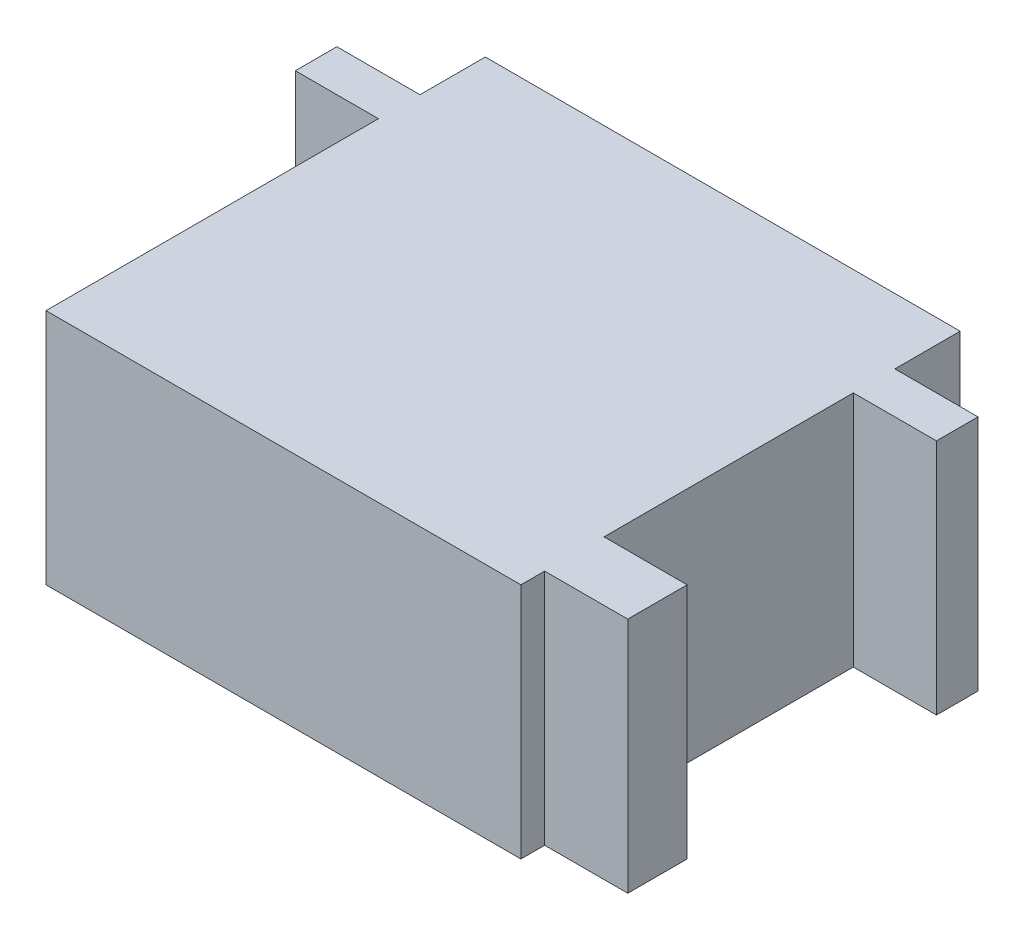
ISO-10303-21;
HEADER;
FILE_DESCRIPTION(('STEP AP214'),'2;1');
FILE_NAME('part.step','',(''),(''),'','','');
FILE_SCHEMA(('AUTOMOTIVE_DESIGN { 1 0 10303 214 1 1 1 1 }'));
ENDSEC;
DATA;
#1=APPLICATION_CONTEXT('core data for automotive mechanical design processes');
#2=APPLICATION_PROTOCOL_DEFINITION('international standard','automotive_design',2000,#1);
#3=PRODUCT_CONTEXT('',#1,'mechanical');
#4=PRODUCT('Part','Part','',(#3));
#5=PRODUCT_RELATED_PRODUCT_CATEGORY('part','',(#4));
#6=PRODUCT_DEFINITION_FORMATION('','',#4);
#7=PRODUCT_DEFINITION_CONTEXT('part definition',#1,'design');
#8=PRODUCT_DEFINITION('design','',#6,#7);
#9=PRODUCT_DEFINITION_SHAPE('','',#8);
#10=(LENGTH_UNIT() NAMED_UNIT(*) SI_UNIT(.MILLI.,.METRE.));
#11=(NAMED_UNIT(*) PLANE_ANGLE_UNIT() SI_UNIT($,.RADIAN.));
#12=(NAMED_UNIT(*) SI_UNIT($,.STERADIAN.) SOLID_ANGLE_UNIT());
#13=UNCERTAINTY_MEASURE_WITH_UNIT(LENGTH_MEASURE(1.E-05),#10,'distance_accuracy_value','');
#14=(GEOMETRIC_REPRESENTATION_CONTEXT(3) GLOBAL_UNCERTAINTY_ASSIGNED_CONTEXT((#13)) GLOBAL_UNIT_ASSIGNED_CONTEXT((#10,
#11,#12)) REPRESENTATION_CONTEXT('',''));
#15=CARTESIAN_POINT('',(0.,0.,0.));
#16=DIRECTION('',(0.,0.,1.));
#17=DIRECTION('',(1.,0.,0.));
#18=AXIS2_PLACEMENT_3D('',#15,#16,#17);
#19=CARTESIAN_POINT('',(0.,20.,0.));
#20=DIRECTION('',(0.,0.,-1.));
#21=DIRECTION('',(-1.,0.,0.));
#22=AXIS2_PLACEMENT_3D('',#19,#20,#21);
#23=PLANE('',#22);
#24=DIRECTION('',(1.,0.,0.));
#25=VECTOR('',#24,1.);
#26=CARTESIAN_POINT('',(0.,0.,0.));
#27=LINE('',#26,#25);
#28=CARTESIAN_POINT('',(0.,0.,0.));
#29=VERTEX_POINT('',#28);
#30=CARTESIAN_POINT('',(40.,0.,0.));
#31=VERTEX_POINT('',#30);
#32=EDGE_CURVE('E183',#29,#31,#27,.T.);
#33=ORIENTED_EDGE('',*,*,#32,.T.);
#34=DIRECTION('',(0.,-1.,0.));
#35=VECTOR('',#34,1.);
#36=CARTESIAN_POINT('',(40.,20.,0.));
#37=LINE('',#36,#35);
#38=CARTESIAN_POINT('',(40.,20.,0.));
#39=VERTEX_POINT('',#38);
#40=EDGE_CURVE('E11',#39,#31,#37,.T.);
#41=ORIENTED_EDGE('',*,*,#40,.F.);
#42=DIRECTION('',(1.,0.,0.));
#43=VECTOR('',#42,1.);
#44=CARTESIAN_POINT('',(0.,20.,0.));
#45=LINE('',#44,#43);
#46=CARTESIAN_POINT('',(0.,20.,0.));
#47=VERTEX_POINT('',#46);
#48=EDGE_CURVE('E225',#47,#39,#45,.T.);
#49=ORIENTED_EDGE('',*,*,#48,.F.);
#50=DIRECTION('',(0.,-1.,0.));
#51=VECTOR('',#50,1.);
#52=CARTESIAN_POINT('',(0.,20.,0.));
#53=LINE('',#52,#51);
#54=EDGE_CURVE('E53',#47,#29,#53,.T.);
#55=ORIENTED_EDGE('',*,*,#54,.T.);
#56=EDGE_LOOP('',(#33,#41,#49,#55));
#57=FACE_BOUND('',#56,.T.);
#58=ADVANCED_FACE('F37',(#57),#23,.F.);
#59=CARTESIAN_POINT('',(40.,20.,0.));
#60=DIRECTION('',(-1.,0.,0.));
#61=DIRECTION('',(0.,0.,1.));
#62=AXIS2_PLACEMENT_3D('',#59,#60,#61);
#63=PLANE('',#62);
#64=DIRECTION('',(0.,0.,-1.));
#65=VECTOR('',#64,1.);
#66=CARTESIAN_POINT('',(40.,0.,0.));
#67=LINE('',#66,#65);
#68=CARTESIAN_POINT('',(40.,0.,-2.));
#69=VERTEX_POINT('',#68);
#70=EDGE_CURVE('E185',#31,#69,#67,.T.);
#71=ORIENTED_EDGE('',*,*,#70,.T.);
#72=DIRECTION('',(0.,-1.,0.));
#73=VECTOR('',#72,1.);
#74=CARTESIAN_POINT('',(40.,20.,-2.));
#75=LINE('',#74,#73);
#76=CARTESIAN_POINT('',(40.,20.,-2.));
#77=VERTEX_POINT('',#76);
#78=EDGE_CURVE('E45',#77,#69,#75,.T.);
#79=ORIENTED_EDGE('',*,*,#78,.F.);
#80=DIRECTION('',(0.,0.,-1.));
#81=VECTOR('',#80,1.);
#82=CARTESIAN_POINT('',(40.,20.,0.));
#83=LINE('',#82,#81);
#84=EDGE_CURVE('E115',#39,#77,#83,.T.);
#85=ORIENTED_EDGE('',*,*,#84,.F.);
#86=ORIENTED_EDGE('',*,*,#40,.T.);
#87=EDGE_LOOP('',(#71,#79,#85,#86));
#88=FACE_BOUND('',#87,.T.);
#89=ADVANCED_FACE('F314',(#88),#63,.F.);
#90=CARTESIAN_POINT('',(0.,20.,-2.));
#91=DIRECTION('',(0.,0.,-1.));
#92=DIRECTION('',(-1.,0.,0.));
#93=AXIS2_PLACEMENT_3D('',#90,#91,#92);
#94=PLANE('',#93);
#95=DIRECTION('',(1.,0.,0.));
#96=VECTOR('',#95,1.);
#97=CARTESIAN_POINT('',(0.,0.,-2.));
#98=LINE('',#97,#96);
#99=CARTESIAN_POINT('',(47.,0.,-2.));
#100=VERTEX_POINT('',#99);
#101=EDGE_CURVE('E188',#69,#100,#98,.T.);
#102=ORIENTED_EDGE('',*,*,#101,.T.);
#103=DIRECTION('',(0.,-1.,0.));
#104=VECTOR('',#103,1.);
#105=CARTESIAN_POINT('',(47.,20.,-2.));
#106=LINE('',#105,#104);
#107=CARTESIAN_POINT('',(47.,20.,-2.));
#108=VERTEX_POINT('',#107);
#109=EDGE_CURVE('E248',#108,#100,#106,.T.);
#110=ORIENTED_EDGE('',*,*,#109,.F.);
#111=DIRECTION('',(1.,0.,0.));
#112=VECTOR('',#111,1.);
#113=CARTESIAN_POINT('',(0.,20.,-2.));
#114=LINE('',#113,#112);
#115=EDGE_CURVE('E255',#77,#108,#114,.T.);
#116=ORIENTED_EDGE('',*,*,#115,.F.);
#117=ORIENTED_EDGE('',*,*,#78,.T.);
#118=EDGE_LOOP('',(#102,#110,#116,#117));
#119=FACE_BOUND('',#118,.T.);
#120=ADVANCED_FACE('F253',(#119),#94,.F.);
#121=CARTESIAN_POINT('',(47.,20.,0.));
#122=DIRECTION('',(1.,0.,0.));
#123=DIRECTION('',(0.,0.,-1.));
#124=AXIS2_PLACEMENT_3D('',#121,#122,#123);
#125=PLANE('',#124);
#126=DIRECTION('',(0.,0.,1.));
#127=VECTOR('',#126,1.);
#128=CARTESIAN_POINT('',(47.,0.,0.));
#129=LINE('',#128,#127);
#130=CARTESIAN_POINT('',(47.,0.,-7.));
#131=VERTEX_POINT('',#130);
#132=EDGE_CURVE('E191',#131,#100,#129,.T.);
#133=ORIENTED_EDGE('',*,*,#132,.F.);
#134=DIRECTION('',(0.,-1.,0.));
#135=VECTOR('',#134,1.);
#136=CARTESIAN_POINT('',(47.,20.,-7.));
#137=LINE('',#136,#135);
#138=CARTESIAN_POINT('',(47.,20.,-7.));
#139=VERTEX_POINT('',#138);
#140=EDGE_CURVE('E246',#139,#131,#137,.T.);
#141=ORIENTED_EDGE('',*,*,#140,.F.);
#142=DIRECTION('',(0.,0.,1.));
#143=VECTOR('',#142,1.);
#144=CARTESIAN_POINT('',(47.,20.,0.));
#145=LINE('',#144,#143);
#146=EDGE_CURVE('E265',#139,#108,#145,.T.);
#147=ORIENTED_EDGE('',*,*,#146,.T.);
#148=ORIENTED_EDGE('',*,*,#109,.T.);
#149=EDGE_LOOP('',(#133,#141,#147,#148));
#150=FACE_BOUND('',#149,.T.);
#151=ADVANCED_FACE('F262',(#150),#125,.T.);
#152=CARTESIAN_POINT('',(0.,20.,-6.99999999999999));
#153=DIRECTION('',(0.,0.,-1.));
#154=DIRECTION('',(-1.,0.,0.));
#155=AXIS2_PLACEMENT_3D('',#152,#153,#154);
#156=PLANE('',#155);
#157=DIRECTION('',(1.,0.,0.));
#158=VECTOR('',#157,1.);
#159=CARTESIAN_POINT('',(0.,0.,-6.99999999999999));
#160=LINE('',#159,#158);
#161=CARTESIAN_POINT('',(40.,0.,-7.));
#162=VERTEX_POINT('',#161);
#163=EDGE_CURVE('E194',#162,#131,#160,.T.);
#164=ORIENTED_EDGE('',*,*,#163,.F.);
#165=DIRECTION('',(0.,-1.,0.));
#166=VECTOR('',#165,1.);
#167=CARTESIAN_POINT('',(40.,20.,-7.));
#168=LINE('',#167,#166);
#169=CARTESIAN_POINT('',(40.,20.,-7.));
#170=VERTEX_POINT('',#169);
#171=EDGE_CURVE('E244',#170,#162,#168,.T.);
#172=ORIENTED_EDGE('',*,*,#171,.F.);
#173=DIRECTION('',(1.,0.,0.));
#174=VECTOR('',#173,1.);
#175=CARTESIAN_POINT('',(0.,20.,-6.99999999999999));
#176=LINE('',#175,#174);
#177=EDGE_CURVE('E268',#170,#139,#176,.T.);
#178=ORIENTED_EDGE('',*,*,#177,.T.);
#179=ORIENTED_EDGE('',*,*,#140,.T.);
#180=EDGE_LOOP('',(#164,#172,#178,#179));
#181=FACE_BOUND('',#180,.T.);
#182=ADVANCED_FACE('F374',(#181),#156,.T.);
#183=CARTESIAN_POINT('',(40.,20.,0.));
#184=DIRECTION('',(-1.,0.,0.));
#185=DIRECTION('',(0.,0.,1.));
#186=AXIS2_PLACEMENT_3D('',#183,#184,#185);
#187=PLANE('',#186);
#188=DIRECTION('',(0.,0.,-1.));
#189=VECTOR('',#188,1.);
#190=CARTESIAN_POINT('',(40.,0.,0.));
#191=LINE('',#190,#189);
#192=CARTESIAN_POINT('',(40.,0.,-28.));
#193=VERTEX_POINT('',#192);
#194=EDGE_CURVE('E197',#162,#193,#191,.T.);
#195=ORIENTED_EDGE('',*,*,#194,.T.);
#196=DIRECTION('',(0.,-1.,0.));
#197=VECTOR('',#196,1.);
#198=CARTESIAN_POINT('',(40.,20.,-28.));
#199=LINE('',#198,#197);
#200=CARTESIAN_POINT('',(40.,20.,-28.));
#201=VERTEX_POINT('',#200);
#202=EDGE_CURVE('E241',#201,#193,#199,.T.);
#203=ORIENTED_EDGE('',*,*,#202,.F.);
#204=DIRECTION('',(0.,0.,-1.));
#205=VECTOR('',#204,1.);
#206=CARTESIAN_POINT('',(40.,20.,0.));
#207=LINE('',#206,#205);
#208=EDGE_CURVE('E270',#170,#201,#207,.T.);
#209=ORIENTED_EDGE('',*,*,#208,.F.);
#210=ORIENTED_EDGE('',*,*,#171,.T.);
#211=EDGE_LOOP('',(#195,#203,#209,#210));
#212=FACE_BOUND('',#211,.T.);
#213=ADVANCED_FACE('F370',(#212),#187,.F.);
#214=CARTESIAN_POINT('',(0.,20.,-28.));
#215=DIRECTION('',(0.,0.,-1.));
#216=DIRECTION('',(-1.,0.,0.));
#217=AXIS2_PLACEMENT_3D('',#214,#215,#216);
#218=PLANE('',#217);
#219=DIRECTION('',(1.,0.,0.));
#220=VECTOR('',#219,1.);
#221=CARTESIAN_POINT('',(0.,0.,-28.));
#222=LINE('',#221,#220);
#223=CARTESIAN_POINT('',(47.,0.,-28.));
#224=VERTEX_POINT('',#223);
#225=EDGE_CURVE('E199',#193,#224,#222,.T.);
#226=ORIENTED_EDGE('',*,*,#225,.T.);
#227=DIRECTION('',(0.,-1.,0.));
#228=VECTOR('',#227,1.);
#229=CARTESIAN_POINT('',(47.,20.,-28.));
#230=LINE('',#229,#228);
#231=CARTESIAN_POINT('',(47.,20.,-28.));
#232=VERTEX_POINT('',#231);
#233=EDGE_CURVE('E239',#232,#224,#230,.T.);
#234=ORIENTED_EDGE('',*,*,#233,.F.);
#235=DIRECTION('',(1.,0.,0.));
#236=VECTOR('',#235,1.);
#237=CARTESIAN_POINT('',(0.,20.,-28.));
#238=LINE('',#237,#236);
#239=EDGE_CURVE('E276',#201,#232,#238,.T.);
#240=ORIENTED_EDGE('',*,*,#239,.F.);
#241=ORIENTED_EDGE('',*,*,#202,.T.);
#242=EDGE_LOOP('',(#226,#234,#240,#241));
#243=FACE_BOUND('',#242,.T.);
#244=ADVANCED_FACE('F366',(#243),#218,.F.);
#245=CARTESIAN_POINT('',(47.,20.,0.));
#246=DIRECTION('',(1.,0.,0.));
#247=DIRECTION('',(0.,0.,-1.));
#248=AXIS2_PLACEMENT_3D('',#245,#246,#247);
#249=PLANE('',#248);
#250=DIRECTION('',(0.,0.,1.));
#251=VECTOR('',#250,1.);
#252=CARTESIAN_POINT('',(47.,0.,0.));
#253=LINE('',#252,#251);
#254=CARTESIAN_POINT('',(47.,0.,-31.5));
#255=VERTEX_POINT('',#254);
#256=EDGE_CURVE('E202',#255,#224,#253,.T.);
#257=ORIENTED_EDGE('',*,*,#256,.F.);
#258=DIRECTION('',(0.,-1.,0.));
#259=VECTOR('',#258,1.);
#260=CARTESIAN_POINT('',(47.,20.,-31.5));
#261=LINE('',#260,#259);
#262=CARTESIAN_POINT('',(47.,20.,-31.5));
#263=VERTEX_POINT('',#262);
#264=EDGE_CURVE('E237',#263,#255,#261,.T.);
#265=ORIENTED_EDGE('',*,*,#264,.F.);
#266=DIRECTION('',(0.,0.,1.));
#267=VECTOR('',#266,1.);
#268=CARTESIAN_POINT('',(47.,20.,0.));
#269=LINE('',#268,#267);
#270=EDGE_CURVE('E278',#263,#232,#269,.T.);
#271=ORIENTED_EDGE('',*,*,#270,.T.);
#272=ORIENTED_EDGE('',*,*,#233,.T.);
#273=EDGE_LOOP('',(#257,#265,#271,#272));
#274=FACE_BOUND('',#273,.T.);
#275=ADVANCED_FACE('F362',(#274),#249,.T.);
#276=CARTESIAN_POINT('',(0.,20.,-31.5));
#277=DIRECTION('',(0.,0.,-1.));
#278=DIRECTION('',(-1.,0.,0.));
#279=AXIS2_PLACEMENT_3D('',#276,#277,#278);
#280=PLANE('',#279);
#281=DIRECTION('',(1.,0.,0.));
#282=VECTOR('',#281,1.);
#283=CARTESIAN_POINT('',(0.,0.,-31.5));
#284=LINE('',#283,#282);
#285=CARTESIAN_POINT('',(40.,0.,-31.5));
#286=VERTEX_POINT('',#285);
#287=EDGE_CURVE('E205',#286,#255,#284,.T.);
#288=ORIENTED_EDGE('',*,*,#287,.F.);
#289=DIRECTION('',(0.,-1.,0.));
#290=VECTOR('',#289,1.);
#291=CARTESIAN_POINT('',(40.,20.,-31.5));
#292=LINE('',#291,#290);
#293=CARTESIAN_POINT('',(40.,20.,-31.5));
#294=VERTEX_POINT('',#293);
#295=EDGE_CURVE('E235',#294,#286,#292,.T.);
#296=ORIENTED_EDGE('',*,*,#295,.F.);
#297=DIRECTION('',(1.,0.,0.));
#298=VECTOR('',#297,1.);
#299=CARTESIAN_POINT('',(0.,20.,-31.5));
#300=LINE('',#299,#298);
#301=EDGE_CURVE('E281',#294,#263,#300,.T.);
#302=ORIENTED_EDGE('',*,*,#301,.T.);
#303=ORIENTED_EDGE('',*,*,#264,.T.);
#304=EDGE_LOOP('',(#288,#296,#302,#303));
#305=FACE_BOUND('',#304,.T.);
#306=ADVANCED_FACE('F356',(#305),#280,.T.);
#307=CARTESIAN_POINT('',(40.,20.,0.));
#308=DIRECTION('',(-1.,0.,0.));
#309=DIRECTION('',(0.,0.,1.));
#310=AXIS2_PLACEMENT_3D('',#307,#308,#309);
#311=PLANE('',#310);
#312=DIRECTION('',(0.,0.,-1.));
#313=VECTOR('',#312,1.);
#314=CARTESIAN_POINT('',(40.,0.,0.));
#315=LINE('',#314,#313);
#316=CARTESIAN_POINT('',(40.,0.,-37.));
#317=VERTEX_POINT('',#316);
#318=EDGE_CURVE('E208',#286,#317,#315,.T.);
#319=ORIENTED_EDGE('',*,*,#318,.T.);
#320=DIRECTION('',(0.,-1.,0.));
#321=VECTOR('',#320,1.);
#322=CARTESIAN_POINT('',(40.,20.,-37.));
#323=LINE('',#322,#321);
#324=CARTESIAN_POINT('',(40.,20.,-37.));
#325=VERTEX_POINT('',#324);
#326=EDGE_CURVE('E233',#325,#317,#323,.T.);
#327=ORIENTED_EDGE('',*,*,#326,.F.);
#328=DIRECTION('',(0.,0.,-1.));
#329=VECTOR('',#328,1.);
#330=CARTESIAN_POINT('',(40.,20.,0.));
#331=LINE('',#330,#329);
#332=EDGE_CURVE('E284',#294,#325,#331,.T.);
#333=ORIENTED_EDGE('',*,*,#332,.F.);
#334=ORIENTED_EDGE('',*,*,#295,.T.);
#335=EDGE_LOOP('',(#319,#327,#333,#334));
#336=FACE_BOUND('',#335,.T.);
#337=ADVANCED_FACE('F351',(#336),#311,.F.);
#338=CARTESIAN_POINT('',(0.,20.,-37.));
#339=DIRECTION('',(0.,0.,-1.));
#340=DIRECTION('',(-1.,0.,0.));
#341=AXIS2_PLACEMENT_3D('',#338,#339,#340);
#342=PLANE('',#341);
#343=CARTESIAN_POINT('',(30.,10.,-37.));
#344=DIRECTION('',(0.,0.,-1.));
#345=DIRECTION('',(-1.,0.,0.));
#346=AXIS2_PLACEMENT_3D('',#343,#344,#345);
#347=CIRCLE('',#346,3.);
#348=CARTESIAN_POINT('',(27.,10.,-37.));
#349=VERTEX_POINT('',#348);
#350=EDGE_CURVE('E342',#349,#349,#347,.T.);
#351=ORIENTED_EDGE('',*,*,#350,.F.);
#352=EDGE_LOOP('',(#351));
#353=FACE_BOUND('',#352,.T.);
#354=DIRECTION('',(1.,0.,0.));
#355=VECTOR('',#354,1.);
#356=CARTESIAN_POINT('',(0.,0.,-37.));
#357=LINE('',#356,#355);
#358=CARTESIAN_POINT('',(0.,0.,-37.));
#359=VERTEX_POINT('',#358);
#360=EDGE_CURVE('E211',#359,#317,#357,.T.);
#361=ORIENTED_EDGE('',*,*,#360,.F.);
#362=DIRECTION('',(0.,-1.,0.));
#363=VECTOR('',#362,1.);
#364=CARTESIAN_POINT('',(0.,20.,-37.));
#365=LINE('',#364,#363);
#366=CARTESIAN_POINT('',(0.,20.,-37.));
#367=VERTEX_POINT('',#366);
#368=EDGE_CURVE('E231',#367,#359,#365,.T.);
#369=ORIENTED_EDGE('',*,*,#368,.F.);
#370=DIRECTION('',(1.,0.,0.));
#371=VECTOR('',#370,1.);
#372=CARTESIAN_POINT('',(0.,20.,-37.));
#373=LINE('',#372,#371);
#374=EDGE_CURVE('E286',#367,#325,#373,.T.);
#375=ORIENTED_EDGE('',*,*,#374,.T.);
#376=ORIENTED_EDGE('',*,*,#326,.T.);
#377=EDGE_LOOP('',(#361,#369,#375,#376));
#378=FACE_BOUND('',#377,.T.);
#379=ADVANCED_FACE('F300',(#353,#378),#342,.T.);
#380=CARTESIAN_POINT('',(0.,20.,0.));
#381=DIRECTION('',(-1.,0.,0.));
#382=DIRECTION('',(0.,0.,1.));
#383=AXIS2_PLACEMENT_3D('',#380,#381,#382);
#384=PLANE('',#383);
#385=DIRECTION('',(0.,0.,-1.));
#386=VECTOR('',#385,1.);
#387=CARTESIAN_POINT('',(0.,0.,0.));
#388=LINE('',#387,#386);
#389=CARTESIAN_POINT('',(0.,0.,-31.5));
#390=VERTEX_POINT('',#389);
#391=EDGE_CURVE('E214',#390,#359,#388,.T.);
#392=ORIENTED_EDGE('',*,*,#391,.F.);
#393=DIRECTION('',(0.,-1.,0.));
#394=VECTOR('',#393,1.);
#395=CARTESIAN_POINT('',(0.,20.,-31.5));
#396=LINE('',#395,#394);
#397=CARTESIAN_POINT('',(0.,20.,-31.5));
#398=VERTEX_POINT('',#397);
#399=EDGE_CURVE('E229',#398,#390,#396,.T.);
#400=ORIENTED_EDGE('',*,*,#399,.F.);
#401=DIRECTION('',(0.,0.,-1.));
#402=VECTOR('',#401,1.);
#403=CARTESIAN_POINT('',(0.,20.,0.));
#404=LINE('',#403,#402);
#405=EDGE_CURVE('E289',#398,#367,#404,.T.);
#406=ORIENTED_EDGE('',*,*,#405,.T.);
#407=ORIENTED_EDGE('',*,*,#368,.T.);
#408=EDGE_LOOP('',(#392,#400,#406,#407));
#409=FACE_BOUND('',#408,.T.);
#410=ADVANCED_FACE('F293',(#409),#384,.T.);
#411=CARTESIAN_POINT('',(0.,20.,-31.5));
#412=DIRECTION('',(0.,0.,1.));
#413=DIRECTION('',(1.,0.,0.));
#414=AXIS2_PLACEMENT_3D('',#411,#412,#413);
#415=PLANE('',#414);
#416=DIRECTION('',(-1.,0.,0.));
#417=VECTOR('',#416,1.);
#418=CARTESIAN_POINT('',(0.,0.,-31.5));
#419=LINE('',#418,#417);
#420=CARTESIAN_POINT('',(-7.,0.,-31.5));
#421=VERTEX_POINT('',#420);
#422=EDGE_CURVE('E217',#390,#421,#419,.T.);
#423=ORIENTED_EDGE('',*,*,#422,.T.);
#424=DIRECTION('',(0.,-1.,0.));
#425=VECTOR('',#424,1.);
#426=CARTESIAN_POINT('',(-7.,20.,-31.5));
#427=LINE('',#426,#425);
#428=CARTESIAN_POINT('',(-7.,20.,-31.5));
#429=VERTEX_POINT('',#428);
#430=EDGE_CURVE('E175',#429,#421,#427,.T.);
#431=ORIENTED_EDGE('',*,*,#430,.F.);
#432=DIRECTION('',(-1.,0.,0.));
#433=VECTOR('',#432,1.);
#434=CARTESIAN_POINT('',(0.,20.,-31.5));
#435=LINE('',#434,#433);
#436=EDGE_CURVE('E163',#398,#429,#435,.T.);
#437=ORIENTED_EDGE('',*,*,#436,.F.);
#438=ORIENTED_EDGE('',*,*,#399,.T.);
#439=EDGE_LOOP('',(#423,#431,#437,#438));
#440=FACE_BOUND('',#439,.T.);
#441=ADVANCED_FACE('F304',(#440),#415,.F.);
#442=CARTESIAN_POINT('',(-7.,20.,0.));
#443=DIRECTION('',(1.,0.,0.));
#444=DIRECTION('',(0.,0.,-1.));
#445=AXIS2_PLACEMENT_3D('',#442,#443,#444);
#446=PLANE('',#445);
#447=DIRECTION('',(0.,0.,1.));
#448=VECTOR('',#447,1.);
#449=CARTESIAN_POINT('',(-7.,0.,0.));
#450=LINE('',#449,#448);
#451=CARTESIAN_POINT('',(-7.,0.,-28.));
#452=VERTEX_POINT('',#451);
#453=EDGE_CURVE('E172',#421,#452,#450,.T.);
#454=ORIENTED_EDGE('',*,*,#453,.T.);
#455=DIRECTION('',(0.,-1.,0.));
#456=VECTOR('',#455,1.);
#457=CARTESIAN_POINT('',(-7.,20.,-28.));
#458=LINE('',#457,#456);
#459=CARTESIAN_POINT('',(-7.,20.,-28.));
#460=VERTEX_POINT('',#459);
#461=EDGE_CURVE('E169',#460,#452,#458,.T.);
#462=ORIENTED_EDGE('',*,*,#461,.F.);
#463=DIRECTION('',(0.,0.,1.));
#464=VECTOR('',#463,1.);
#465=CARTESIAN_POINT('',(-7.,20.,0.));
#466=LINE('',#465,#464);
#467=EDGE_CURVE('E155',#429,#460,#466,.T.);
#468=ORIENTED_EDGE('',*,*,#467,.F.);
#469=ORIENTED_EDGE('',*,*,#430,.T.);
#470=EDGE_LOOP('',(#454,#462,#468,#469));
#471=FACE_BOUND('',#470,.T.);
#472=ADVANCED_FACE('F170',(#471),#446,.F.);
#473=CARTESIAN_POINT('',(0.,20.,-28.));
#474=DIRECTION('',(0.,0.,1.));
#475=DIRECTION('',(1.,0.,0.));
#476=AXIS2_PLACEMENT_3D('',#473,#474,#475);
#477=PLANE('',#476);
#478=DIRECTION('',(-1.,0.,0.));
#479=VECTOR('',#478,1.);
#480=CARTESIAN_POINT('',(0.,0.,-28.));
#481=LINE('',#480,#479);
#482=CARTESIAN_POINT('',(0.,0.,-28.));
#483=VERTEX_POINT('',#482);
#484=EDGE_CURVE('E220',#483,#452,#481,.T.);
#485=ORIENTED_EDGE('',*,*,#484,.F.);
#486=DIRECTION('',(0.,-1.,0.));
#487=VECTOR('',#486,1.);
#488=CARTESIAN_POINT('',(0.,20.,-28.));
#489=LINE('',#488,#487);
#490=CARTESIAN_POINT('',(0.,20.,-28.));
#491=VERTEX_POINT('',#490);
#492=EDGE_CURVE('E103',#491,#483,#489,.T.);
#493=ORIENTED_EDGE('',*,*,#492,.F.);
#494=DIRECTION('',(-1.,0.,0.));
#495=VECTOR('',#494,1.);
#496=CARTESIAN_POINT('',(0.,20.,-28.));
#497=LINE('',#496,#495);
#498=EDGE_CURVE('E160',#491,#460,#497,.T.);
#499=ORIENTED_EDGE('',*,*,#498,.T.);
#500=ORIENTED_EDGE('',*,*,#461,.T.);
#501=EDGE_LOOP('',(#485,#493,#499,#500));
#502=FACE_BOUND('',#501,.T.);
#503=ADVANCED_FACE('F177',(#502),#477,.T.);
#504=CARTESIAN_POINT('',(0.,20.,0.));
#505=DIRECTION('',(-1.,0.,0.));
#506=DIRECTION('',(0.,0.,1.));
#507=AXIS2_PLACEMENT_3D('',#504,#505,#506);
#508=PLANE('',#507);
#509=DIRECTION('',(0.,0.,-1.));
#510=VECTOR('',#509,1.);
#511=CARTESIAN_POINT('',(0.,0.,0.));
#512=LINE('',#511,#510);
#513=EDGE_CURVE('E222',#29,#483,#512,.T.);
#514=ORIENTED_EDGE('',*,*,#513,.F.);
#515=ORIENTED_EDGE('',*,*,#54,.F.);
#516=DIRECTION('',(0.,0.,-1.));
#517=VECTOR('',#516,1.);
#518=CARTESIAN_POINT('',(0.,20.,0.));
#519=LINE('',#518,#517);
#520=EDGE_CURVE('E178',#47,#491,#519,.T.);
#521=ORIENTED_EDGE('',*,*,#520,.T.);
#522=ORIENTED_EDGE('',*,*,#492,.T.);
#523=EDGE_LOOP('',(#514,#515,#521,#522));
#524=FACE_BOUND('',#523,.T.);
#525=ADVANCED_FACE('F319',(#524),#508,.T.);
#526=CARTESIAN_POINT('',(0.,20.,0.));
#527=DIRECTION('',(0.,1.,0.));
#528=DIRECTION('',(0.,0.,1.));
#529=AXIS2_PLACEMENT_3D('',#526,#527,#528);
#530=PLANE('',#529);
#531=ORIENTED_EDGE('',*,*,#48,.T.);
#532=ORIENTED_EDGE('',*,*,#84,.T.);
#533=ORIENTED_EDGE('',*,*,#115,.T.);
#534=ORIENTED_EDGE('',*,*,#146,.F.);
#535=ORIENTED_EDGE('',*,*,#177,.F.);
#536=ORIENTED_EDGE('',*,*,#208,.T.);
#537=ORIENTED_EDGE('',*,*,#239,.T.);
#538=ORIENTED_EDGE('',*,*,#270,.F.);
#539=ORIENTED_EDGE('',*,*,#301,.F.);
#540=ORIENTED_EDGE('',*,*,#332,.T.);
#541=ORIENTED_EDGE('',*,*,#374,.F.);
#542=ORIENTED_EDGE('',*,*,#405,.F.);
#543=ORIENTED_EDGE('',*,*,#436,.T.);
#544=ORIENTED_EDGE('',*,*,#467,.T.);
#545=ORIENTED_EDGE('',*,*,#498,.F.);
#546=ORIENTED_EDGE('',*,*,#520,.F.);
#547=EDGE_LOOP('',(#531,#532,#533,#534,#535,#536,#537,#538,#539,#540,#541,#542,#543,#544,#545,#546));
#548=FACE_BOUND('',#547,.T.);
#549=ADVANCED_FACE('F157',(#548),#530,.T.);
#550=CARTESIAN_POINT('',(0.,0.,0.));
#551=DIRECTION('',(0.,1.,0.));
#552=DIRECTION('',(0.,0.,1.));
#553=AXIS2_PLACEMENT_3D('',#550,#551,#552);
#554=PLANE('',#553);
#555=ORIENTED_EDGE('',*,*,#32,.F.);
#556=ORIENTED_EDGE('',*,*,#513,.T.);
#557=ORIENTED_EDGE('',*,*,#484,.T.);
#558=ORIENTED_EDGE('',*,*,#453,.F.);
#559=ORIENTED_EDGE('',*,*,#422,.F.);
#560=ORIENTED_EDGE('',*,*,#391,.T.);
#561=ORIENTED_EDGE('',*,*,#360,.T.);
#562=ORIENTED_EDGE('',*,*,#318,.F.);
#563=ORIENTED_EDGE('',*,*,#287,.T.);
#564=ORIENTED_EDGE('',*,*,#256,.T.);
#565=ORIENTED_EDGE('',*,*,#225,.F.);
#566=ORIENTED_EDGE('',*,*,#194,.F.);
#567=ORIENTED_EDGE('',*,*,#163,.T.);
#568=ORIENTED_EDGE('',*,*,#132,.T.);
#569=ORIENTED_EDGE('',*,*,#101,.F.);
#570=ORIENTED_EDGE('',*,*,#70,.F.);
#571=EDGE_LOOP('',(#555,#556,#557,#558,#559,#560,#561,#562,#563,#564,#565,#566,#567,#568,#569,#570));
#572=FACE_BOUND('',#571,.T.);
#573=ADVANCED_FACE('F257',(#572),#554,.F.);
#574=CARTESIAN_POINT('',(30.,10.,-42.));
#575=DIRECTION('',(0.,0.,1.));
#576=DIRECTION('',(1.,0.,0.));
#577=AXIS2_PLACEMENT_3D('',#574,#575,#576);
#578=CYLINDRICAL_SURFACE('',#577,3.);
#579=CARTESIAN_POINT('',(30.,10.,-42.));
#580=DIRECTION('',(0.,0.,-1.));
#581=DIRECTION('',(-1.,0.,0.));
#582=AXIS2_PLACEMENT_3D('',#579,#580,#581);
#583=CIRCLE('',#582,3.);
#584=CARTESIAN_POINT('',(27.,10.,-42.));
#585=VERTEX_POINT('',#584);
#586=EDGE_CURVE('E186',#585,#585,#583,.T.);
#587=ORIENTED_EDGE('',*,*,#586,.F.);
#588=EDGE_LOOP('',(#587));
#589=FACE_BOUND('',#588,.T.);
#590=ORIENTED_EDGE('',*,*,#350,.T.);
#591=EDGE_LOOP('',(#590));
#592=FACE_BOUND('',#591,.T.);
#593=ADVANCED_FACE('F330',(#589,#592),#578,.T.);
#594=CARTESIAN_POINT('',(30.,10.,-42.));
#595=DIRECTION('',(0.,0.,-1.));
#596=DIRECTION('',(-1.,0.,0.));
#597=AXIS2_PLACEMENT_3D('',#594,#595,#596);
#598=PLANE('',#597);
#599=ORIENTED_EDGE('',*,*,#586,.T.);
#600=EDGE_LOOP('',(#599));
#601=FACE_BOUND('',#600,.T.);
#602=ADVANCED_FACE('F334',(#601),#598,.T.);
#603=CLOSED_SHELL('',(#58,#89,#120,#151,#182,#213,#244,#275,#306,#337,#379,#410,#441,#472,#503,
#525,#549,#573,#593,#602));
#604=MANIFOLD_SOLID_BREP('B2',#603);
#605=ADVANCED_BREP_SHAPE_REPRESENTATION('',(#18,#604),#14);
#606=SHAPE_DEFINITION_REPRESENTATION(#9,#605);
ENDSEC;
END-ISO-10303-21;
